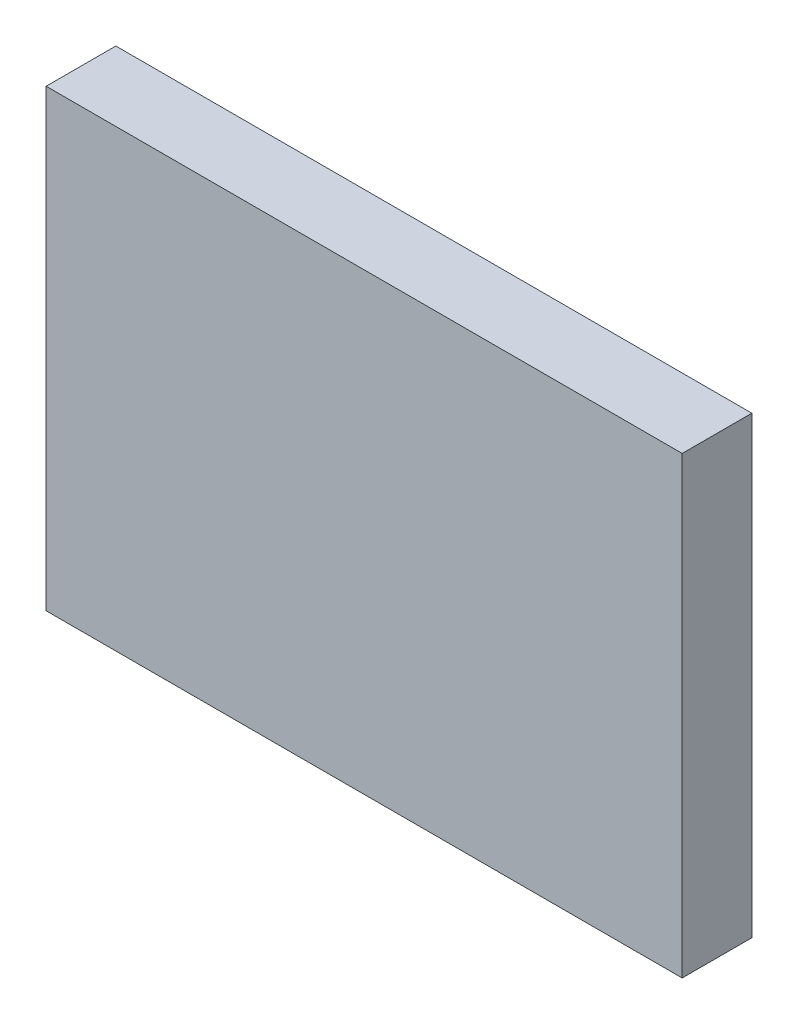
ISO-10303-21;
HEADER;
FILE_DESCRIPTION(('STEP AP214'),'2;1');
FILE_NAME('part.step','',(''),(''),'','','');
FILE_SCHEMA(('AUTOMOTIVE_DESIGN { 1 0 10303 214 1 1 1 1 }'));
ENDSEC;
DATA;
#1=APPLICATION_CONTEXT('core data for automotive mechanical design processes');
#2=APPLICATION_PROTOCOL_DEFINITION('international standard','automotive_design',2000,#1);
#3=PRODUCT_CONTEXT('',#1,'mechanical');
#4=PRODUCT('Part','Part','',(#3));
#5=PRODUCT_RELATED_PRODUCT_CATEGORY('part','',(#4));
#6=PRODUCT_DEFINITION_FORMATION('','',#4);
#7=PRODUCT_DEFINITION_CONTEXT('part definition',#1,'design');
#8=PRODUCT_DEFINITION('design','',#6,#7);
#9=PRODUCT_DEFINITION_SHAPE('','',#8);
#10=(LENGTH_UNIT() NAMED_UNIT(*) SI_UNIT(.MILLI.,.METRE.));
#11=(NAMED_UNIT(*) PLANE_ANGLE_UNIT() SI_UNIT($,.RADIAN.));
#12=(NAMED_UNIT(*) SI_UNIT($,.STERADIAN.) SOLID_ANGLE_UNIT());
#13=UNCERTAINTY_MEASURE_WITH_UNIT(LENGTH_MEASURE(1.E-05),#10,'distance_accuracy_value','');
#14=(GEOMETRIC_REPRESENTATION_CONTEXT(3) GLOBAL_UNCERTAINTY_ASSIGNED_CONTEXT((#13)) GLOBAL_UNIT_ASSIGNED_CONTEXT((#10,
#11,#12)) REPRESENTATION_CONTEXT('',''));
#15=CARTESIAN_POINT('',(0.,0.,0.));
#16=DIRECTION('',(0.,0.,1.));
#17=DIRECTION('',(1.,0.,0.));
#18=AXIS2_PLACEMENT_3D('',#15,#16,#17);
#19=CARTESIAN_POINT('',(43.8074919711418,38.2816209172633,2.3));
#20=DIRECTION('',(1.,0.,0.));
#21=DIRECTION('',(0.,1.,0.));
#22=AXIS2_PLACEMENT_3D('',#19,#20,#21);
#23=PLANE('',#22);
#24=DIRECTION('',(0.,-1.,0.));
#25=VECTOR('',#24,1.);
#26=CARTESIAN_POINT('',(43.8074919711418,38.2816209172633,0.));
#27=LINE('',#26,#25);
#28=CARTESIAN_POINT('',(43.8074919711418,38.2816209172633,0.));
#29=VERTEX_POINT('',#28);
#30=CARTESIAN_POINT('',(43.8074919711418,23.2816209172633,0.));
#31=VERTEX_POINT('',#30);
#32=EDGE_CURVE('E100',#29,#31,#27,.T.);
#33=ORIENTED_EDGE('',*,*,#32,.T.);
#34=DIRECTION('',(0.,0.,-1.));
#35=VECTOR('',#34,1.);
#36=CARTESIAN_POINT('',(43.8074919711418,23.2816209172633,2.3));
#37=LINE('',#36,#35);
#38=CARTESIAN_POINT('',(43.8074919711418,23.2816209172633,2.3));
#39=VERTEX_POINT('',#38);
#40=EDGE_CURVE('E11',#39,#31,#37,.T.);
#41=ORIENTED_EDGE('',*,*,#40,.F.);
#42=DIRECTION('',(0.,-1.,0.));
#43=VECTOR('',#42,1.);
#44=CARTESIAN_POINT('',(43.8074919711418,38.2816209172633,2.3));
#45=LINE('',#44,#43);
#46=CARTESIAN_POINT('',(43.8074919711418,38.2816209172633,2.3));
#47=VERTEX_POINT('',#46);
#48=EDGE_CURVE('E88',#47,#39,#45,.T.);
#49=ORIENTED_EDGE('',*,*,#48,.F.);
#50=DIRECTION('',(0.,0.,-1.));
#51=VECTOR('',#50,1.);
#52=CARTESIAN_POINT('',(43.8074919711418,38.2816209172633,2.3));
#53=LINE('',#52,#51);
#54=EDGE_CURVE('E96',#47,#29,#53,.T.);
#55=ORIENTED_EDGE('',*,*,#54,.T.);
#56=EDGE_LOOP('',(#33,#41,#49,#55));
#57=FACE_BOUND('',#56,.T.);
#58=ADVANCED_FACE('F37',(#57),#23,.F.);
#59=CARTESIAN_POINT('',(43.8074919711418,23.2816209172633,2.3));
#60=DIRECTION('',(0.,1.,0.));
#61=DIRECTION('',(0.,0.,1.));
#62=AXIS2_PLACEMENT_3D('',#59,#60,#61);
#63=PLANE('',#62);
#64=DIRECTION('',(1.,0.,0.));
#65=VECTOR('',#64,1.);
#66=CARTESIAN_POINT('',(43.8074919711418,23.2816209172633,0.));
#67=LINE('',#66,#65);
#68=CARTESIAN_POINT('',(64.8074919711418,23.2816209172633,0.));
#69=VERTEX_POINT('',#68);
#70=EDGE_CURVE('E92',#31,#69,#67,.T.);
#71=ORIENTED_EDGE('',*,*,#70,.T.);
#72=DIRECTION('',(0.,0.,-1.));
#73=VECTOR('',#72,1.);
#74=CARTESIAN_POINT('',(64.8074919711418,23.2816209172633,2.3));
#75=LINE('',#74,#73);
#76=CARTESIAN_POINT('',(64.8074919711418,23.2816209172633,2.3));
#77=VERTEX_POINT('',#76);
#78=EDGE_CURVE('E45',#77,#69,#75,.T.);
#79=ORIENTED_EDGE('',*,*,#78,.F.);
#80=DIRECTION('',(1.,0.,0.));
#81=VECTOR('',#80,1.);
#82=CARTESIAN_POINT('',(43.8074919711418,23.2816209172633,2.3));
#83=LINE('',#82,#81);
#84=EDGE_CURVE('E83',#39,#77,#83,.T.);
#85=ORIENTED_EDGE('',*,*,#84,.F.);
#86=ORIENTED_EDGE('',*,*,#40,.T.);
#87=EDGE_LOOP('',(#71,#79,#85,#86));
#88=FACE_BOUND('',#87,.T.);
#89=ADVANCED_FACE('F91',(#88),#63,.F.);
#90=CARTESIAN_POINT('',(64.8074919711418,38.2816209172633,2.3));
#91=DIRECTION('',(-1.,0.,0.));
#92=DIRECTION('',(0.,-1.,0.));
#93=AXIS2_PLACEMENT_3D('',#90,#91,#92);
#94=PLANE('',#93);
#95=DIRECTION('',(0.,1.,0.));
#96=VECTOR('',#95,1.);
#97=CARTESIAN_POINT('',(64.8074919711418,38.2816209172633,0.));
#98=LINE('',#97,#96);
#99=CARTESIAN_POINT('',(64.8074919711418,38.2816209172633,0.));
#100=VERTEX_POINT('',#99);
#101=EDGE_CURVE('E70',#69,#100,#98,.T.);
#102=ORIENTED_EDGE('',*,*,#101,.T.);
#103=DIRECTION('',(0.,0.,-1.));
#104=VECTOR('',#103,1.);
#105=CARTESIAN_POINT('',(64.8074919711418,38.2816209172633,2.3));
#106=LINE('',#105,#104);
#107=CARTESIAN_POINT('',(64.8074919711418,38.2816209172633,2.3));
#108=VERTEX_POINT('',#107);
#109=EDGE_CURVE('E93',#108,#100,#106,.T.);
#110=ORIENTED_EDGE('',*,*,#109,.F.);
#111=DIRECTION('',(0.,1.,0.));
#112=VECTOR('',#111,1.);
#113=CARTESIAN_POINT('',(64.8074919711418,38.2816209172633,2.3));
#114=LINE('',#113,#112);
#115=EDGE_CURVE('E86',#77,#108,#114,.T.);
#116=ORIENTED_EDGE('',*,*,#115,.F.);
#117=ORIENTED_EDGE('',*,*,#78,.T.);
#118=EDGE_LOOP('',(#102,#110,#116,#117));
#119=FACE_BOUND('',#118,.T.);
#120=ADVANCED_FACE('F94',(#119),#94,.F.);
#121=CARTESIAN_POINT('',(43.8074919711418,38.2816209172633,2.3));
#122=DIRECTION('',(0.,-1.,0.));
#123=DIRECTION('',(0.,0.,-1.));
#124=AXIS2_PLACEMENT_3D('',#121,#122,#123);
#125=PLANE('',#124);
#126=DIRECTION('',(-1.,0.,0.));
#127=VECTOR('',#126,1.);
#128=CARTESIAN_POINT('',(43.8074919711418,38.2816209172633,0.));
#129=LINE('',#128,#127);
#130=EDGE_CURVE('E76',#100,#29,#129,.T.);
#131=ORIENTED_EDGE('',*,*,#130,.T.);
#132=ORIENTED_EDGE('',*,*,#54,.F.);
#133=DIRECTION('',(-1.,0.,0.));
#134=VECTOR('',#133,1.);
#135=CARTESIAN_POINT('',(43.8074919711418,38.2816209172633,2.3));
#136=LINE('',#135,#134);
#137=EDGE_CURVE('E53',#108,#47,#136,.T.);
#138=ORIENTED_EDGE('',*,*,#137,.F.);
#139=ORIENTED_EDGE('',*,*,#109,.T.);
#140=EDGE_LOOP('',(#131,#132,#138,#139));
#141=FACE_BOUND('',#140,.T.);
#142=ADVANCED_FACE('F107',(#141),#125,.F.);
#143=CARTESIAN_POINT('',(0.,0.,2.3));
#144=DIRECTION('',(0.,0.,1.));
#145=DIRECTION('',(1.,0.,0.));
#146=AXIS2_PLACEMENT_3D('',#143,#144,#145);
#147=PLANE('',#146);
#148=ORIENTED_EDGE('',*,*,#48,.T.);
#149=ORIENTED_EDGE('',*,*,#84,.T.);
#150=ORIENTED_EDGE('',*,*,#115,.T.);
#151=ORIENTED_EDGE('',*,*,#137,.T.);
#152=EDGE_LOOP('',(#148,#149,#150,#151));
#153=FACE_BOUND('',#152,.T.);
#154=ADVANCED_FACE('F84',(#153),#147,.T.);
#155=CARTESIAN_POINT('',(0.,0.,0.));
#156=DIRECTION('',(0.,0.,1.));
#157=DIRECTION('',(1.,0.,0.));
#158=AXIS2_PLACEMENT_3D('',#155,#156,#157);
#159=PLANE('',#158);
#160=ORIENTED_EDGE('',*,*,#32,.F.);
#161=ORIENTED_EDGE('',*,*,#130,.F.);
#162=ORIENTED_EDGE('',*,*,#101,.F.);
#163=ORIENTED_EDGE('',*,*,#70,.F.);
#164=EDGE_LOOP('',(#160,#161,#162,#163));
#165=FACE_BOUND('',#164,.T.);
#166=ADVANCED_FACE('F110',(#165),#159,.F.);
#167=CLOSED_SHELL('',(#58,#89,#120,#142,#154,#166));
#168=MANIFOLD_SOLID_BREP('B2',#167);
#169=ADVANCED_BREP_SHAPE_REPRESENTATION('',(#18,#168),#14);
#170=SHAPE_DEFINITION_REPRESENTATION(#9,#169);
ENDSEC;
END-ISO-10303-21;
